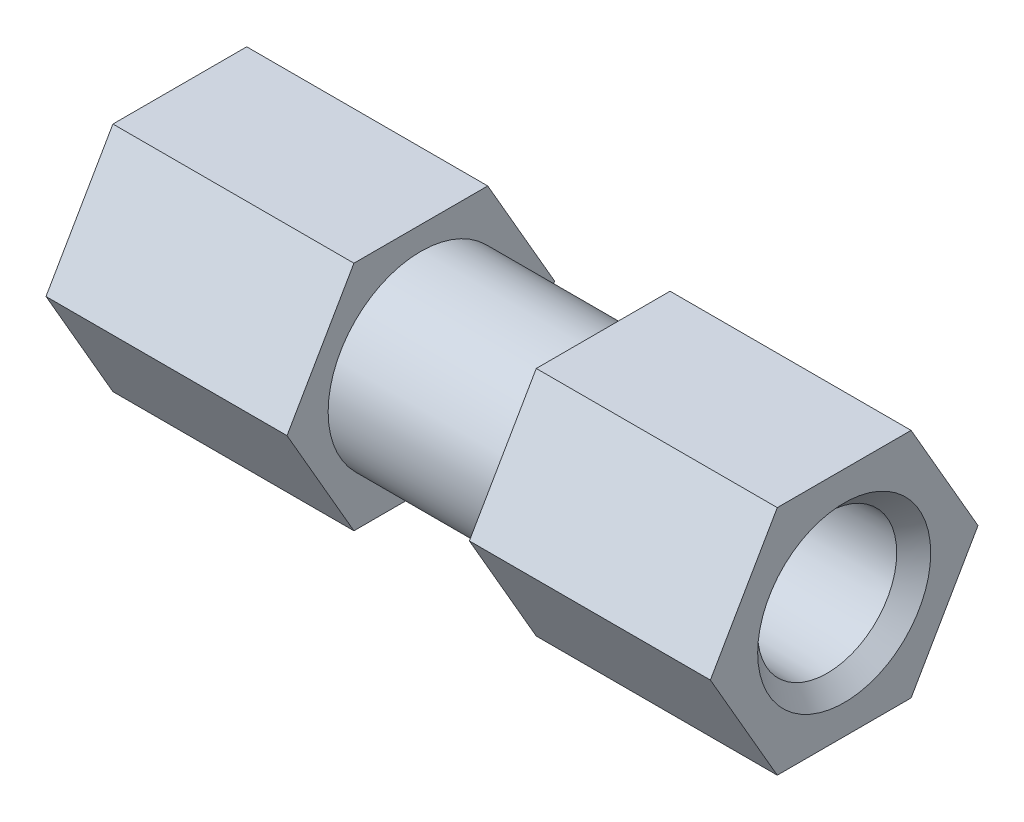
ISO-10303-21;
HEADER;
FILE_DESCRIPTION(('STEP AP214'),'2;1');
FILE_NAME('part.step','',(''),(''),'','','');
FILE_SCHEMA(('AUTOMOTIVE_DESIGN { 1 0 10303 214 1 1 1 1 }'));
ENDSEC;
DATA;
#1=APPLICATION_CONTEXT('core data for automotive mechanical design processes');
#2=APPLICATION_PROTOCOL_DEFINITION('international standard','automotive_design',2000,#1);
#3=PRODUCT_CONTEXT('',#1,'mechanical');
#4=PRODUCT('Part','Part','',(#3));
#5=PRODUCT_RELATED_PRODUCT_CATEGORY('part','',(#4));
#6=PRODUCT_DEFINITION_FORMATION('','',#4);
#7=PRODUCT_DEFINITION_CONTEXT('part definition',#1,'design');
#8=PRODUCT_DEFINITION('design','',#6,#7);
#9=PRODUCT_DEFINITION_SHAPE('','',#8);
#10=(LENGTH_UNIT() NAMED_UNIT(*) SI_UNIT(.MILLI.,.METRE.));
#11=(NAMED_UNIT(*) PLANE_ANGLE_UNIT() SI_UNIT($,.RADIAN.));
#12=(NAMED_UNIT(*) SI_UNIT($,.STERADIAN.) SOLID_ANGLE_UNIT());
#13=UNCERTAINTY_MEASURE_WITH_UNIT(LENGTH_MEASURE(1.E-05),#10,'distance_accuracy_value','');
#14=(GEOMETRIC_REPRESENTATION_CONTEXT(3) GLOBAL_UNCERTAINTY_ASSIGNED_CONTEXT((#13)) GLOBAL_UNIT_ASSIGNED_CONTEXT((#10,
#11,#12)) REPRESENTATION_CONTEXT('',''));
#15=CARTESIAN_POINT('',(0.,0.,0.));
#16=DIRECTION('',(0.,0.,1.));
#17=DIRECTION('',(1.,0.,0.));
#18=AXIS2_PLACEMENT_3D('',#15,#16,#17);
#19=CARTESIAN_POINT('',(19.812,0.,10.9985226280624));
#20=DIRECTION('',(0.,0.500000000000002,0.866025403784438));
#21=DIRECTION('',(0.,-0.866025403784438,0.500000000000002));
#22=AXIS2_PLACEMENT_3D('',#19,#20,#21);
#23=PLANE('',#22);
#24=DIRECTION('',(0.,0.866025403784438,-0.500000000000002));
#25=VECTOR('',#24,1.);
#26=CARTESIAN_POINT('',(0.,0.,10.9985226280624));
#27=LINE('',#26,#25);
#28=CARTESIAN_POINT('',(0.,0.,10.9985226280624));
#29=VERTEX_POINT('',#28);
#30=CARTESIAN_POINT('',(0.,9.525,5.49926131403119));
#31=VERTEX_POINT('',#30);
#32=EDGE_CURVE('E127',#29,#31,#27,.T.);
#33=ORIENTED_EDGE('',*,*,#32,.F.);
#34=DIRECTION('',(-1.,0.,0.));
#35=VECTOR('',#34,1.);
#36=CARTESIAN_POINT('',(19.812,0.,10.9985226280624));
#37=LINE('',#36,#35);
#38=CARTESIAN_POINT('',(19.812,0.,10.9985226280624));
#39=VERTEX_POINT('',#38);
#40=EDGE_CURVE('E52',#39,#29,#37,.T.);
#41=ORIENTED_EDGE('',*,*,#40,.F.);
#42=DIRECTION('',(0.,0.866025403784438,-0.500000000000002));
#43=VECTOR('',#42,1.);
#44=CARTESIAN_POINT('',(19.812,0.,10.9985226280624));
#45=LINE('',#44,#43);
#46=CARTESIAN_POINT('',(19.812,9.525,5.49926131403119));
#47=VERTEX_POINT('',#46);
#48=EDGE_CURVE('E143',#39,#47,#45,.T.);
#49=ORIENTED_EDGE('',*,*,#48,.T.);
#50=DIRECTION('',(-1.,0.,0.));
#51=VECTOR('',#50,1.);
#52=CARTESIAN_POINT('',(19.812,9.525,5.49926131403119));
#53=LINE('',#52,#51);
#54=EDGE_CURVE('E88',#47,#31,#53,.T.);
#55=ORIENTED_EDGE('',*,*,#54,.T.);
#56=EDGE_LOOP('',(#33,#41,#49,#55));
#57=FACE_BOUND('',#56,.T.);
#58=ADVANCED_FACE('F35',(#57),#23,.T.);
#59=CARTESIAN_POINT('',(19.812,-9.525,5.49926131403118));
#60=DIRECTION('',(0.,-0.500000000000002,0.866025403784438));
#61=DIRECTION('',(0.,-0.866025403784438,-0.500000000000002));
#62=AXIS2_PLACEMENT_3D('',#59,#60,#61);
#63=PLANE('',#62);
#64=DIRECTION('',(0.,0.866025403784438,0.500000000000002));
#65=VECTOR('',#64,1.);
#66=CARTESIAN_POINT('',(0.,-9.525,5.49926131403118));
#67=LINE('',#66,#65);
#68=CARTESIAN_POINT('',(0.,-9.525,5.49926131403118));
#69=VERTEX_POINT('',#68);
#70=EDGE_CURVE('E140',#69,#29,#67,.T.);
#71=ORIENTED_EDGE('',*,*,#70,.F.);
#72=DIRECTION('',(-1.,0.,0.));
#73=VECTOR('',#72,1.);
#74=CARTESIAN_POINT('',(19.812,-9.525,5.49926131403118));
#75=LINE('',#74,#73);
#76=CARTESIAN_POINT('',(19.812,-9.525,5.49926131403118));
#77=VERTEX_POINT('',#76);
#78=EDGE_CURVE('E76',#77,#69,#75,.T.);
#79=ORIENTED_EDGE('',*,*,#78,.F.);
#80=DIRECTION('',(0.,0.866025403784438,0.500000000000002));
#81=VECTOR('',#80,1.);
#82=CARTESIAN_POINT('',(19.812,-9.525,5.49926131403118));
#83=LINE('',#82,#81);
#84=EDGE_CURVE('E117',#77,#39,#83,.T.);
#85=ORIENTED_EDGE('',*,*,#84,.T.);
#86=ORIENTED_EDGE('',*,*,#40,.T.);
#87=EDGE_LOOP('',(#71,#79,#85,#86));
#88=FACE_BOUND('',#87,.T.);
#89=ADVANCED_FACE('F171',(#88),#63,.T.);
#90=CARTESIAN_POINT('',(19.812,-9.525,-5.49926131403119));
#91=DIRECTION('',(0.,-1.,0.));
#92=DIRECTION('',(0.,0.,-1.));
#93=AXIS2_PLACEMENT_3D('',#90,#91,#92);
#94=PLANE('',#93);
#95=DIRECTION('',(0.,0.,1.));
#96=VECTOR('',#95,1.);
#97=CARTESIAN_POINT('',(0.,-9.525,-5.49926131403119));
#98=LINE('',#97,#96);
#99=CARTESIAN_POINT('',(0.,-9.525,-5.49926131403119));
#100=VERTEX_POINT('',#99);
#101=EDGE_CURVE('E104',#100,#69,#98,.T.);
#102=ORIENTED_EDGE('',*,*,#101,.F.);
#103=DIRECTION('',(-1.,0.,0.));
#104=VECTOR('',#103,1.);
#105=CARTESIAN_POINT('',(19.812,-9.525,-5.49926131403119));
#106=LINE('',#105,#104);
#107=CARTESIAN_POINT('',(19.812,-9.525,-5.49926131403119));
#108=VERTEX_POINT('',#107);
#109=EDGE_CURVE('E99',#108,#100,#106,.T.);
#110=ORIENTED_EDGE('',*,*,#109,.F.);
#111=DIRECTION('',(0.,0.,1.));
#112=VECTOR('',#111,1.);
#113=CARTESIAN_POINT('',(19.812,-9.525,-5.49926131403119));
#114=LINE('',#113,#112);
#115=EDGE_CURVE('E102',#108,#77,#114,.T.);
#116=ORIENTED_EDGE('',*,*,#115,.T.);
#117=ORIENTED_EDGE('',*,*,#78,.T.);
#118=EDGE_LOOP('',(#102,#110,#116,#117));
#119=FACE_BOUND('',#118,.T.);
#120=ADVANCED_FACE('F101',(#119),#94,.T.);
#121=CARTESIAN_POINT('',(19.812,0.,-10.9985226280624));
#122=DIRECTION('',(0.,-0.500000000000001,-0.866025403784438));
#123=DIRECTION('',(0.,0.866025403784438,-0.500000000000001));
#124=AXIS2_PLACEMENT_3D('',#121,#122,#123);
#125=PLANE('',#124);
#126=DIRECTION('',(0.,-0.866025403784438,0.500000000000001));
#127=VECTOR('',#126,1.);
#128=CARTESIAN_POINT('',(0.,0.,-10.9985226280624));
#129=LINE('',#128,#127);
#130=CARTESIAN_POINT('',(0.,0.,-10.9985226280624));
#131=VERTEX_POINT('',#130);
#132=EDGE_CURVE('E137',#131,#100,#129,.T.);
#133=ORIENTED_EDGE('',*,*,#132,.F.);
#134=DIRECTION('',(-1.,0.,0.));
#135=VECTOR('',#134,1.);
#136=CARTESIAN_POINT('',(19.812,0.,-10.9985226280624));
#137=LINE('',#136,#135);
#138=CARTESIAN_POINT('',(19.812,0.,-10.9985226280624));
#139=VERTEX_POINT('',#138);
#140=EDGE_CURVE('E109',#139,#131,#137,.T.);
#141=ORIENTED_EDGE('',*,*,#140,.F.);
#142=DIRECTION('',(0.,-0.866025403784438,0.500000000000001));
#143=VECTOR('',#142,1.);
#144=CARTESIAN_POINT('',(19.812,0.,-10.9985226280624));
#145=LINE('',#144,#143);
#146=EDGE_CURVE('E115',#139,#108,#145,.T.);
#147=ORIENTED_EDGE('',*,*,#146,.T.);
#148=ORIENTED_EDGE('',*,*,#109,.T.);
#149=EDGE_LOOP('',(#133,#141,#147,#148));
#150=FACE_BOUND('',#149,.T.);
#151=ADVANCED_FACE('F119',(#150),#125,.T.);
#152=CARTESIAN_POINT('',(19.812,9.52499999999999,-5.49926131403119));
#153=DIRECTION('',(0.,0.500000000000001,-0.866025403784438));
#154=DIRECTION('',(0.,0.866025403784438,0.500000000000001));
#155=AXIS2_PLACEMENT_3D('',#152,#153,#154);
#156=PLANE('',#155);
#157=DIRECTION('',(0.,-0.866025403784438,-0.500000000000001));
#158=VECTOR('',#157,1.);
#159=CARTESIAN_POINT('',(0.,9.52499999999999,-5.49926131403119));
#160=LINE('',#159,#158);
#161=CARTESIAN_POINT('',(0.,9.52499999999999,-5.49926131403119));
#162=VERTEX_POINT('',#161);
#163=EDGE_CURVE('E134',#162,#131,#160,.T.);
#164=ORIENTED_EDGE('',*,*,#163,.F.);
#165=DIRECTION('',(-1.,0.,0.));
#166=VECTOR('',#165,1.);
#167=CARTESIAN_POINT('',(19.812,9.52499999999999,-5.49926131403119));
#168=LINE('',#167,#166);
#169=CARTESIAN_POINT('',(19.812,9.52499999999999,-5.49926131403119));
#170=VERTEX_POINT('',#169);
#171=EDGE_CURVE('E148',#170,#162,#168,.T.);
#172=ORIENTED_EDGE('',*,*,#171,.F.);
#173=DIRECTION('',(0.,-0.866025403784438,-0.500000000000001));
#174=VECTOR('',#173,1.);
#175=CARTESIAN_POINT('',(19.812,9.52499999999999,-5.49926131403119));
#176=LINE('',#175,#174);
#177=EDGE_CURVE('E120',#170,#139,#176,.T.);
#178=ORIENTED_EDGE('',*,*,#177,.T.);
#179=ORIENTED_EDGE('',*,*,#140,.T.);
#180=EDGE_LOOP('',(#164,#172,#178,#179));
#181=FACE_BOUND('',#180,.T.);
#182=ADVANCED_FACE('F181',(#181),#156,.T.);
#183=CARTESIAN_POINT('',(19.812,9.525,5.49926131403119));
#184=DIRECTION('',(0.,1.,0.));
#185=DIRECTION('',(0.,0.,1.));
#186=AXIS2_PLACEMENT_3D('',#183,#184,#185);
#187=PLANE('',#186);
#188=DIRECTION('',(0.,0.,-1.));
#189=VECTOR('',#188,1.);
#190=CARTESIAN_POINT('',(0.,9.525,5.49926131403119));
#191=LINE('',#190,#189);
#192=EDGE_CURVE('E130',#31,#162,#191,.T.);
#193=ORIENTED_EDGE('',*,*,#192,.F.);
#194=ORIENTED_EDGE('',*,*,#54,.F.);
#195=DIRECTION('',(0.,0.,-1.));
#196=VECTOR('',#195,1.);
#197=CARTESIAN_POINT('',(19.812,9.525,5.49926131403119));
#198=LINE('',#197,#196);
#199=EDGE_CURVE('E122',#47,#170,#198,.T.);
#200=ORIENTED_EDGE('',*,*,#199,.T.);
#201=ORIENTED_EDGE('',*,*,#171,.T.);
#202=EDGE_LOOP('',(#193,#194,#200,#201));
#203=FACE_BOUND('',#202,.T.);
#204=ADVANCED_FACE('F178',(#203),#187,.T.);
#205=CARTESIAN_POINT('',(19.812,0.,0.));
#206=DIRECTION('',(-1.,0.,0.));
#207=DIRECTION('',(0.,-1.,0.));
#208=AXIS2_PLACEMENT_3D('',#205,#206,#207);
#209=PLANE('',#208);
#210=CARTESIAN_POINT('',(19.812,0.,0.));
#211=DIRECTION('',(1.,0.,0.));
#212=DIRECTION('',(0.,1.,0.));
#213=AXIS2_PLACEMENT_3D('',#210,#211,#212);
#214=CIRCLE('',#213,7.62);
#215=CARTESIAN_POINT('',(19.812,7.62,0.));
#216=VERTEX_POINT('',#215);
#217=EDGE_CURVE('E145',#216,#216,#214,.T.);
#218=ORIENTED_EDGE('',*,*,#217,.F.);
#219=EDGE_LOOP('',(#218));
#220=FACE_BOUND('',#219,.T.);
#221=ORIENTED_EDGE('',*,*,#48,.F.);
#222=ORIENTED_EDGE('',*,*,#84,.F.);
#223=ORIENTED_EDGE('',*,*,#115,.F.);
#224=ORIENTED_EDGE('',*,*,#146,.F.);
#225=ORIENTED_EDGE('',*,*,#177,.F.);
#226=ORIENTED_EDGE('',*,*,#199,.F.);
#227=EDGE_LOOP('',(#221,#222,#223,#224,#225,#226));
#228=FACE_BOUND('',#227,.T.);
#229=ADVANCED_FACE('F113',(#220,#228),#209,.F.);
#230=CARTESIAN_POINT('',(0.,0.,0.));
#231=DIRECTION('',(-1.,0.,0.));
#232=DIRECTION('',(0.,-1.,0.));
#233=AXIS2_PLACEMENT_3D('',#230,#231,#232);
#234=PLANE('',#233);
#235=CARTESIAN_POINT('',(0.,0.,0.));
#236=DIRECTION('',(-1.,0.,0.));
#237=DIRECTION('',(0.,-1.,0.));
#238=AXIS2_PLACEMENT_3D('',#235,#236,#237);
#239=CIRCLE('',#238,7.11200000010658);
#240=CARTESIAN_POINT('',(0.,-7.11200000010658,0.));
#241=VERTEX_POINT('',#240);
#242=EDGE_CURVE('E11',#241,#241,#239,.F.);
#243=ORIENTED_EDGE('',*,*,#242,.T.);
#244=EDGE_LOOP('',(#243));
#245=FACE_BOUND('',#244,.T.);
#246=ORIENTED_EDGE('',*,*,#32,.T.);
#247=ORIENTED_EDGE('',*,*,#192,.T.);
#248=ORIENTED_EDGE('',*,*,#163,.T.);
#249=ORIENTED_EDGE('',*,*,#132,.T.);
#250=ORIENTED_EDGE('',*,*,#101,.T.);
#251=ORIENTED_EDGE('',*,*,#70,.T.);
#252=EDGE_LOOP('',(#246,#247,#248,#249,#250,#251));
#253=FACE_BOUND('',#252,.T.);
#254=ADVANCED_FACE('F189',(#245,#253),#234,.T.);
#255=CARTESIAN_POINT('',(34.798,0.,0.));
#256=DIRECTION('',(-1.,0.,0.));
#257=DIRECTION('',(0.,-1.,0.));
#258=AXIS2_PLACEMENT_3D('',#255,#256,#257);
#259=CYLINDRICAL_SURFACE('',#258,7.62);
#260=CARTESIAN_POINT('',(34.798,0.,0.));
#261=DIRECTION('',(1.,0.,0.));
#262=DIRECTION('',(0.,1.,0.));
#263=AXIS2_PLACEMENT_3D('',#260,#261,#262);
#264=CIRCLE('',#263,7.62);
#265=CARTESIAN_POINT('',(34.798,7.62,0.));
#266=VERTEX_POINT('',#265);
#267=EDGE_CURVE('E131',#266,#266,#264,.T.);
#268=ORIENTED_EDGE('',*,*,#267,.F.);
#269=EDGE_LOOP('',(#268));
#270=FACE_BOUND('',#269,.T.);
#271=ORIENTED_EDGE('',*,*,#217,.T.);
#272=EDGE_LOOP('',(#271));
#273=FACE_BOUND('',#272,.T.);
#274=ADVANCED_FACE('F192',(#270,#273),#259,.T.);
#275=CARTESIAN_POINT('',(54.61,0.,-10.9985226280624));
#276=DIRECTION('',(0.,-0.500000000000001,-0.866025403784438));
#277=DIRECTION('',(0.,0.866025403784438,-0.500000000000001));
#278=AXIS2_PLACEMENT_3D('',#275,#276,#277);
#279=PLANE('',#278);
#280=DIRECTION('',(0.,-0.866025403784438,0.500000000000001));
#281=VECTOR('',#280,1.);
#282=CARTESIAN_POINT('',(34.798,0.,-10.9985226280624));
#283=LINE('',#282,#281);
#284=CARTESIAN_POINT('',(34.798,0.,-10.9985226280624));
#285=VERTEX_POINT('',#284);
#286=CARTESIAN_POINT('',(34.798,-9.52499999999999,-5.49926131403119));
#287=VERTEX_POINT('',#286);
#288=EDGE_CURVE('E385',#285,#287,#283,.T.);
#289=ORIENTED_EDGE('',*,*,#288,.F.);
#290=DIRECTION('',(-1.,0.,0.));
#291=VECTOR('',#290,1.);
#292=CARTESIAN_POINT('',(54.61,0.,-10.9985226280624));
#293=LINE('',#292,#291);
#294=CARTESIAN_POINT('',(54.61,0.,-10.9985226280624));
#295=VERTEX_POINT('',#294);
#296=EDGE_CURVE('E424',#295,#285,#293,.T.);
#297=ORIENTED_EDGE('',*,*,#296,.F.);
#298=DIRECTION('',(0.,-0.866025403784438,0.500000000000001));
#299=VECTOR('',#298,1.);
#300=CARTESIAN_POINT('',(54.61,0.,-10.9985226280624));
#301=LINE('',#300,#299);
#302=CARTESIAN_POINT('',(54.61,-9.52499999999999,-5.49926131403119));
#303=VERTEX_POINT('',#302);
#304=EDGE_CURVE('E388',#295,#303,#301,.T.);
#305=ORIENTED_EDGE('',*,*,#304,.T.);
#306=DIRECTION('',(-1.,0.,0.));
#307=VECTOR('',#306,1.);
#308=CARTESIAN_POINT('',(54.61,-9.52499999999999,-5.49926131403119));
#309=LINE('',#308,#307);
#310=EDGE_CURVE('E407',#303,#287,#309,.T.);
#311=ORIENTED_EDGE('',*,*,#310,.T.);
#312=EDGE_LOOP('',(#289,#297,#305,#311));
#313=FACE_BOUND('',#312,.T.);
#314=ADVANCED_FACE('F199',(#313),#279,.T.);
#315=CARTESIAN_POINT('',(54.61,9.525,-5.49926131403119));
#316=DIRECTION('',(0.,0.500000000000001,-0.866025403784438));
#317=DIRECTION('',(0.,0.866025403784438,0.500000000000001));
#318=AXIS2_PLACEMENT_3D('',#315,#316,#317);
#319=PLANE('',#318);
#320=DIRECTION('',(0.,-0.866025403784438,-0.500000000000001));
#321=VECTOR('',#320,1.);
#322=CARTESIAN_POINT('',(34.798,9.525,-5.49926131403119));
#323=LINE('',#322,#321);
#324=CARTESIAN_POINT('',(34.798,9.525,-5.49926131403119));
#325=VERTEX_POINT('',#324);
#326=EDGE_CURVE('E392',#325,#285,#323,.T.);
#327=ORIENTED_EDGE('',*,*,#326,.F.);
#328=DIRECTION('',(-1.,0.,0.));
#329=VECTOR('',#328,1.);
#330=CARTESIAN_POINT('',(54.61,9.525,-5.49926131403119));
#331=LINE('',#330,#329);
#332=CARTESIAN_POINT('',(54.61,9.525,-5.49926131403119));
#333=VERTEX_POINT('',#332);
#334=EDGE_CURVE('E427',#333,#325,#331,.T.);
#335=ORIENTED_EDGE('',*,*,#334,.F.);
#336=DIRECTION('',(0.,-0.866025403784438,-0.500000000000001));
#337=VECTOR('',#336,1.);
#338=CARTESIAN_POINT('',(54.61,9.525,-5.49926131403119));
#339=LINE('',#338,#337);
#340=EDGE_CURVE('E404',#333,#295,#339,.T.);
#341=ORIENTED_EDGE('',*,*,#340,.T.);
#342=ORIENTED_EDGE('',*,*,#296,.T.);
#343=EDGE_LOOP('',(#327,#335,#341,#342));
#344=FACE_BOUND('',#343,.T.);
#345=ADVANCED_FACE('F203',(#344),#319,.T.);
#346=CARTESIAN_POINT('',(54.61,9.525,5.49926131403118));
#347=DIRECTION('',(0.,1.,0.));
#348=DIRECTION('',(0.,0.,1.));
#349=AXIS2_PLACEMENT_3D('',#346,#347,#348);
#350=PLANE('',#349);
#351=DIRECTION('',(0.,0.,-1.));
#352=VECTOR('',#351,1.);
#353=CARTESIAN_POINT('',(34.798,9.525,5.49926131403118));
#354=LINE('',#353,#352);
#355=CARTESIAN_POINT('',(34.798,9.525,5.49926131403118));
#356=VERTEX_POINT('',#355);
#357=EDGE_CURVE('E419',#356,#325,#354,.T.);
#358=ORIENTED_EDGE('',*,*,#357,.F.);
#359=DIRECTION('',(-1.,0.,0.));
#360=VECTOR('',#359,1.);
#361=CARTESIAN_POINT('',(54.61,9.525,5.49926131403118));
#362=LINE('',#361,#360);
#363=CARTESIAN_POINT('',(54.61,9.525,5.49926131403118));
#364=VERTEX_POINT('',#363);
#365=EDGE_CURVE('E430',#364,#356,#362,.T.);
#366=ORIENTED_EDGE('',*,*,#365,.F.);
#367=DIRECTION('',(0.,0.,-1.));
#368=VECTOR('',#367,1.);
#369=CARTESIAN_POINT('',(54.61,9.525,5.49926131403118));
#370=LINE('',#369,#368);
#371=EDGE_CURVE('E401',#364,#333,#370,.T.);
#372=ORIENTED_EDGE('',*,*,#371,.T.);
#373=ORIENTED_EDGE('',*,*,#334,.T.);
#374=EDGE_LOOP('',(#358,#366,#372,#373));
#375=FACE_BOUND('',#374,.T.);
#376=ADVANCED_FACE('F217',(#375),#350,.T.);
#377=CARTESIAN_POINT('',(54.61,0.,10.9985226280624));
#378=DIRECTION('',(0.,0.500000000000002,0.866025403784437));
#379=DIRECTION('',(0.,-0.866025403784438,0.500000000000002));
#380=AXIS2_PLACEMENT_3D('',#377,#378,#379);
#381=PLANE('',#380);
#382=DIRECTION('',(0.,0.866025403784438,-0.500000000000002));
#383=VECTOR('',#382,1.);
#384=CARTESIAN_POINT('',(34.798,0.,10.9985226280624));
#385=LINE('',#384,#383);
#386=CARTESIAN_POINT('',(34.798,0.,10.9985226280624));
#387=VERTEX_POINT('',#386);
#388=EDGE_CURVE('E416',#387,#356,#385,.T.);
#389=ORIENTED_EDGE('',*,*,#388,.F.);
#390=DIRECTION('',(-1.,0.,0.));
#391=VECTOR('',#390,1.);
#392=CARTESIAN_POINT('',(54.61,0.,10.9985226280624));
#393=LINE('',#392,#391);
#394=CARTESIAN_POINT('',(54.61,0.,10.9985226280624));
#395=VERTEX_POINT('',#394);
#396=EDGE_CURVE('E433',#395,#387,#393,.T.);
#397=ORIENTED_EDGE('',*,*,#396,.F.);
#398=DIRECTION('',(0.,0.866025403784438,-0.500000000000002));
#399=VECTOR('',#398,1.);
#400=CARTESIAN_POINT('',(54.61,0.,10.9985226280624));
#401=LINE('',#400,#399);
#402=EDGE_CURVE('E398',#395,#364,#401,.T.);
#403=ORIENTED_EDGE('',*,*,#402,.T.);
#404=ORIENTED_EDGE('',*,*,#365,.T.);
#405=EDGE_LOOP('',(#389,#397,#403,#404));
#406=FACE_BOUND('',#405,.T.);
#407=ADVANCED_FACE('F213',(#406),#381,.T.);
#408=CARTESIAN_POINT('',(54.61,-9.525,5.49926131403119));
#409=DIRECTION('',(0.,-0.500000000000001,0.866025403784438));
#410=DIRECTION('',(0.,-0.866025403784438,-0.500000000000001));
#411=AXIS2_PLACEMENT_3D('',#408,#409,#410);
#412=PLANE('',#411);
#413=DIRECTION('',(0.,0.866025403784438,0.500000000000001));
#414=VECTOR('',#413,1.);
#415=CARTESIAN_POINT('',(34.798,-9.525,5.49926131403119));
#416=LINE('',#415,#414);
#417=CARTESIAN_POINT('',(34.798,-9.525,5.49926131403119));
#418=VERTEX_POINT('',#417);
#419=EDGE_CURVE('E413',#418,#387,#416,.T.);
#420=ORIENTED_EDGE('',*,*,#419,.F.);
#421=DIRECTION('',(-1.,0.,0.));
#422=VECTOR('',#421,1.);
#423=CARTESIAN_POINT('',(54.61,-9.525,5.49926131403119));
#424=LINE('',#423,#422);
#425=CARTESIAN_POINT('',(54.61,-9.525,5.49926131403119));
#426=VERTEX_POINT('',#425);
#427=EDGE_CURVE('E436',#426,#418,#424,.T.);
#428=ORIENTED_EDGE('',*,*,#427,.F.);
#429=DIRECTION('',(0.,0.866025403784438,0.500000000000001));
#430=VECTOR('',#429,1.);
#431=CARTESIAN_POINT('',(54.61,-9.525,5.49926131403119));
#432=LINE('',#431,#430);
#433=EDGE_CURVE('E395',#426,#395,#432,.T.);
#434=ORIENTED_EDGE('',*,*,#433,.T.);
#435=ORIENTED_EDGE('',*,*,#396,.T.);
#436=EDGE_LOOP('',(#420,#428,#434,#435));
#437=FACE_BOUND('',#436,.T.);
#438=ADVANCED_FACE('F209',(#437),#412,.T.);
#439=CARTESIAN_POINT('',(54.61,-9.52499999999999,-5.49926131403119));
#440=DIRECTION('',(0.,-1.,0.));
#441=DIRECTION('',(0.,0.,-1.));
#442=AXIS2_PLACEMENT_3D('',#439,#440,#441);
#443=PLANE('',#442);
#444=DIRECTION('',(0.,0.,1.));
#445=VECTOR('',#444,1.);
#446=CARTESIAN_POINT('',(34.798,-9.52499999999999,-5.49926131403119));
#447=LINE('',#446,#445);
#448=EDGE_CURVE('E410',#287,#418,#447,.T.);
#449=ORIENTED_EDGE('',*,*,#448,.F.);
#450=ORIENTED_EDGE('',*,*,#310,.F.);
#451=DIRECTION('',(0.,0.,1.));
#452=VECTOR('',#451,1.);
#453=CARTESIAN_POINT('',(54.61,-9.52499999999999,-5.49926131403119));
#454=LINE('',#453,#452);
#455=EDGE_CURVE('E391',#303,#426,#454,.T.);
#456=ORIENTED_EDGE('',*,*,#455,.T.);
#457=ORIENTED_EDGE('',*,*,#427,.T.);
#458=EDGE_LOOP('',(#449,#450,#456,#457));
#459=FACE_BOUND('',#458,.T.);
#460=ADVANCED_FACE('F205',(#459),#443,.T.);
#461=CARTESIAN_POINT('',(54.61,0.,0.));
#462=DIRECTION('',(-1.,0.,0.));
#463=DIRECTION('',(0.,0.,1.));
#464=AXIS2_PLACEMENT_3D('',#461,#462,#463);
#465=PLANE('',#464);
#466=CARTESIAN_POINT('',(54.61,0.,0.));
#467=DIRECTION('',(-1.,0.,0.));
#468=DIRECTION('',(0.,0.,1.));
#469=AXIS2_PLACEMENT_3D('',#466,#467,#468);
#470=CIRCLE('',#469,7.11200000010777);
#471=CARTESIAN_POINT('',(54.61,0.,7.11200000010777));
#472=VERTEX_POINT('',#471);
#473=EDGE_CURVE('E154',#472,#472,#470,.T.);
#474=ORIENTED_EDGE('',*,*,#473,.T.);
#475=EDGE_LOOP('',(#474));
#476=FACE_BOUND('',#475,.T.);
#477=ORIENTED_EDGE('',*,*,#304,.F.);
#478=ORIENTED_EDGE('',*,*,#340,.F.);
#479=ORIENTED_EDGE('',*,*,#371,.F.);
#480=ORIENTED_EDGE('',*,*,#402,.F.);
#481=ORIENTED_EDGE('',*,*,#433,.F.);
#482=ORIENTED_EDGE('',*,*,#455,.F.);
#483=EDGE_LOOP('',(#477,#478,#479,#480,#481,#482));
#484=FACE_BOUND('',#483,.T.);
#485=ADVANCED_FACE('F208',(#476,#484),#465,.F.);
#486=CARTESIAN_POINT('',(34.798,0.,0.));
#487=DIRECTION('',(-1.,0.,0.));
#488=DIRECTION('',(0.,0.,1.));
#489=AXIS2_PLACEMENT_3D('',#486,#487,#488);
#490=PLANE('',#489);
#491=ORIENTED_EDGE('',*,*,#267,.T.);
#492=EDGE_LOOP('',(#491));
#493=FACE_BOUND('',#492,.T.);
#494=ORIENTED_EDGE('',*,*,#288,.T.);
#495=ORIENTED_EDGE('',*,*,#448,.T.);
#496=ORIENTED_EDGE('',*,*,#419,.T.);
#497=ORIENTED_EDGE('',*,*,#388,.T.);
#498=ORIENTED_EDGE('',*,*,#357,.T.);
#499=ORIENTED_EDGE('',*,*,#326,.T.);
#500=EDGE_LOOP('',(#494,#495,#496,#497,#498,#499));
#501=FACE_BOUND('',#500,.T.);
#502=ADVANCED_FACE('F225',(#493,#501),#490,.T.);
#503=CARTESIAN_POINT('',(44.7040000000243,0.,0.));
#504=DIRECTION('',(-1.,0.,0.));
#505=DIRECTION('',(0.,0.,1.));
#506=AXIS2_PLACEMENT_3D('',#503,#504,#505);
#507=PLANE('',#506);
#508=CARTESIAN_POINT('',(44.7040000000243,0.,0.));
#509=DIRECTION('',(1.,0.,0.));
#510=DIRECTION('',(0.,0.,-1.));
#511=AXIS2_PLACEMENT_3D('',#508,#509,#510);
#512=CIRCLE('',#511,5.49664228964244);
#513=CARTESIAN_POINT('',(44.7040000000243,0.,-5.49664228964244));
#514=VERTEX_POINT('',#513);
#515=EDGE_CURVE('E382',#514,#514,#512,.T.);
#516=ORIENTED_EDGE('',*,*,#515,.T.);
#517=EDGE_LOOP('',(#516));
#518=FACE_BOUND('',#517,.T.);
#519=ADVANCED_FACE('F228',(#518),#507,.F.);
#520=CARTESIAN_POINT('',(54.61,0.,0.));
#521=DIRECTION('',(1.,0.,0.));
#522=DIRECTION('',(0.,0.,-1.));
#523=AXIS2_PLACEMENT_3D('',#520,#521,#522);
#524=CONICAL_SURFACE('',#523,5.75084977334199,0.025656340004192);
#525=CARTESIAN_POINT('',(53.212999999889,0.,0.));
#526=DIRECTION('',(-1.,0.,0.));
#527=DIRECTION('',(0.,0.,1.));
#528=AXIS2_PLACEMENT_3D('',#525,#526,#527);
#529=CIRCLE('',#528,5.71499999999681);
#530=CARTESIAN_POINT('',(53.212999999889,0.,5.71499999999681));
#531=VERTEX_POINT('',#530);
#532=EDGE_CURVE('E151',#531,#531,#529,.F.);
#533=ORIENTED_EDGE('',*,*,#532,.T.);
#534=EDGE_LOOP('',(#533));
#535=FACE_BOUND('',#534,.T.);
#536=ORIENTED_EDGE('',*,*,#515,.F.);
#537=EDGE_LOOP('',(#536));
#538=FACE_BOUND('',#537,.T.);
#539=ADVANCED_FACE('F235',(#535,#538),#524,.F.);
#540=CARTESIAN_POINT('',(9.90600000000086,0.,0.));
#541=DIRECTION('',(1.,0.,0.));
#542=DIRECTION('',(0.,0.,-1.));
#543=AXIS2_PLACEMENT_3D('',#540,#541,#542);
#544=PLANE('',#543);
#545=CARTESIAN_POINT('',(9.90600000000086,0.,0.));
#546=DIRECTION('',(-1.,0.,0.));
#547=DIRECTION('',(0.,0.,1.));
#548=AXIS2_PLACEMENT_3D('',#545,#546,#547);
#549=CIRCLE('',#548,5.49664228964099);
#550=CARTESIAN_POINT('',(9.90600000000086,0.,5.49664228964099));
#551=VERTEX_POINT('',#550);
#552=EDGE_CURVE('E381',#551,#551,#549,.T.);
#553=ORIENTED_EDGE('',*,*,#552,.T.);
#554=EDGE_LOOP('',(#553));
#555=FACE_BOUND('',#554,.T.);
#556=ADVANCED_FACE('F239',(#555),#544,.F.);
#557=CARTESIAN_POINT('',(0.,0.,0.));
#558=DIRECTION('',(-1.,0.,0.));
#559=DIRECTION('',(0.,0.,1.));
#560=AXIS2_PLACEMENT_3D('',#557,#558,#559);
#561=CONICAL_SURFACE('',#560,5.7508497733408,0.0256563400041546);
#562=CARTESIAN_POINT('',(1.39700000011089,0.,0.));
#563=DIRECTION('',(-1.,0.,0.));
#564=DIRECTION('',(0.,0.,1.));
#565=AXIS2_PLACEMENT_3D('',#562,#563,#564);
#566=CIRCLE('',#565,5.71499999999568);
#567=CARTESIAN_POINT('',(1.39700000011089,0.,5.71499999999568));
#568=VERTEX_POINT('',#567);
#569=EDGE_CURVE('E44',#568,#568,#566,.T.);
#570=ORIENTED_EDGE('',*,*,#569,.T.);
#571=EDGE_LOOP('',(#570));
#572=FACE_BOUND('',#571,.T.);
#573=ORIENTED_EDGE('',*,*,#552,.F.);
#574=EDGE_LOOP('',(#573));
#575=FACE_BOUND('',#574,.T.);
#576=ADVANCED_FACE('F159',(#572,#575),#561,.F.);
#577=CARTESIAN_POINT('',(53.2129999998891,0.,0.));
#578=DIRECTION('',(1.,0.,0.));
#579=DIRECTION('',(0.,0.,-1.));
#580=AXIS2_PLACEMENT_3D('',#577,#578,#579);
#581=CONICAL_SURFACE('',#580,5.71499999999681,0.785398163397457);
#582=ORIENTED_EDGE('',*,*,#473,.F.);
#583=EDGE_LOOP('',(#582));
#584=FACE_BOUND('',#583,.T.);
#585=ORIENTED_EDGE('',*,*,#532,.F.);
#586=EDGE_LOOP('',(#585));
#587=FACE_BOUND('',#586,.T.);
#588=ADVANCED_FACE('F163',(#584,#587),#581,.F.);
#589=CARTESIAN_POINT('',(1.39700000011089,0.,0.));
#590=DIRECTION('',(-1.,0.,0.));
#591=DIRECTION('',(0.,-1.,0.));
#592=AXIS2_PLACEMENT_3D('',#589,#590,#591);
#593=CONICAL_SURFACE('',#592,5.71499999999568,0.785398163397451);
#594=ORIENTED_EDGE('',*,*,#242,.F.);
#595=EDGE_LOOP('',(#594));
#596=FACE_BOUND('',#595,.T.);
#597=ORIENTED_EDGE('',*,*,#569,.F.);
#598=EDGE_LOOP('',(#597));
#599=FACE_BOUND('',#598,.T.);
#600=ADVANCED_FACE('F37',(#596,#599),#593,.F.);
#601=CLOSED_SHELL('',(#58,#89,#120,#151,#182,#204,#229,#254,#274,#314,#345,#376,#407,#438,#460,
#485,#502,#519,#539,#556,#576,#588,#600));
#602=MANIFOLD_SOLID_BREP('B2',#601);
#603=ADVANCED_BREP_SHAPE_REPRESENTATION('',(#18,#602),#14);
#604=SHAPE_DEFINITION_REPRESENTATION(#9,#603);
ENDSEC;
END-ISO-10303-21;
